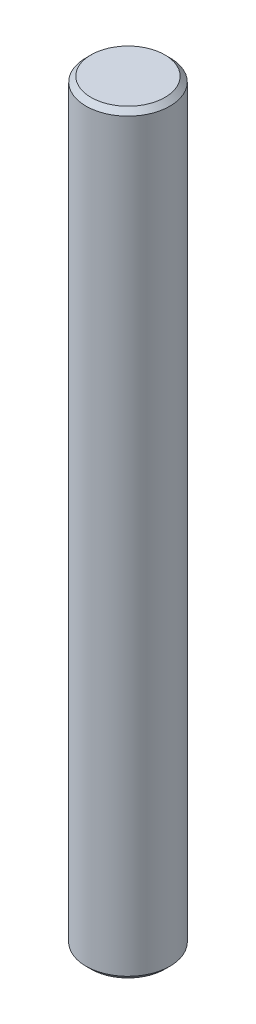
ISO-10303-21;
HEADER;
FILE_DESCRIPTION(('STEP AP214'),'2;1');
FILE_NAME('part.step','',(''),(''),'','','');
FILE_SCHEMA(('AUTOMOTIVE_DESIGN { 1 0 10303 214 1 1 1 1 }'));
ENDSEC;
DATA;
#1=APPLICATION_CONTEXT('core data for automotive mechanical design processes');
#2=APPLICATION_PROTOCOL_DEFINITION('international standard','automotive_design',2000,#1);
#3=PRODUCT_CONTEXT('',#1,'mechanical');
#4=PRODUCT('Part','Part','',(#3));
#5=PRODUCT_RELATED_PRODUCT_CATEGORY('part','',(#4));
#6=PRODUCT_DEFINITION_FORMATION('','',#4);
#7=PRODUCT_DEFINITION_CONTEXT('part definition',#1,'design');
#8=PRODUCT_DEFINITION('design','',#6,#7);
#9=PRODUCT_DEFINITION_SHAPE('','',#8);
#10=(LENGTH_UNIT() NAMED_UNIT(*) SI_UNIT(.MILLI.,.METRE.));
#11=(NAMED_UNIT(*) PLANE_ANGLE_UNIT() SI_UNIT($,.RADIAN.));
#12=(NAMED_UNIT(*) SI_UNIT($,.STERADIAN.) SOLID_ANGLE_UNIT());
#13=UNCERTAINTY_MEASURE_WITH_UNIT(LENGTH_MEASURE(1.E-05),#10,'distance_accuracy_value','');
#14=(GEOMETRIC_REPRESENTATION_CONTEXT(3) GLOBAL_UNCERTAINTY_ASSIGNED_CONTEXT((#13)) GLOBAL_UNIT_ASSIGNED_CONTEXT((#10,
#11,#12)) REPRESENTATION_CONTEXT('',''));
#15=CARTESIAN_POINT('',(0.,0.,0.));
#16=DIRECTION('',(0.,0.,1.));
#17=DIRECTION('',(1.,0.,0.));
#18=AXIS2_PLACEMENT_3D('',#15,#16,#17);
#19=CARTESIAN_POINT('',(0.,45.,0.));
#20=DIRECTION('',(0.,-1.,0.));
#21=DIRECTION('',(0.,0.,-1.));
#22=AXIS2_PLACEMENT_3D('',#19,#20,#21);
#23=CYLINDRICAL_SURFACE('',#22,2.5);
#24=CARTESIAN_POINT('',(0.,0.300000000000043,0.));
#25=DIRECTION('',(0.,1.,0.));
#26=DIRECTION('',(0.,0.,1.));
#27=AXIS2_PLACEMENT_3D('',#24,#25,#26);
#28=CIRCLE('',#27,2.5);
#29=CARTESIAN_POINT('',(0.,0.300000000000043,2.5));
#30=VERTEX_POINT('',#29);
#31=EDGE_CURVE('E43',#30,#30,#28,.T.);
#32=ORIENTED_EDGE('',*,*,#31,.T.);
#33=EDGE_LOOP('',(#32));
#34=FACE_BOUND('',#33,.T.);
#35=CARTESIAN_POINT('',(0.,44.7,0.));
#36=DIRECTION('',(0.,1.,0.));
#37=DIRECTION('',(0.,0.,1.));
#38=AXIS2_PLACEMENT_3D('',#35,#36,#37);
#39=CIRCLE('',#38,2.5);
#40=CARTESIAN_POINT('',(0.,44.7,2.5));
#41=VERTEX_POINT('',#40);
#42=EDGE_CURVE('E47',#41,#41,#39,.F.);
#43=ORIENTED_EDGE('',*,*,#42,.T.);
#44=EDGE_LOOP('',(#43));
#45=FACE_BOUND('',#44,.T.);
#46=ADVANCED_FACE('F32',(#34,#45),#23,.T.);
#47=CARTESIAN_POINT('',(0.,45.,0.));
#48=DIRECTION('',(0.,1.,0.));
#49=DIRECTION('',(0.,0.,1.));
#50=AXIS2_PLACEMENT_3D('',#47,#48,#49);
#51=PLANE('',#50);
#52=CARTESIAN_POINT('',(0.,45.,0.));
#53=DIRECTION('',(0.,1.,0.));
#54=DIRECTION('',(0.,0.,1.));
#55=AXIS2_PLACEMENT_3D('',#52,#53,#54);
#56=CIRCLE('',#55,2.20000000000001);
#57=CARTESIAN_POINT('',(0.,45.,2.20000000000001));
#58=VERTEX_POINT('',#57);
#59=EDGE_CURVE('E10',#58,#58,#56,.T.);
#60=ORIENTED_EDGE('',*,*,#59,.T.);
#61=EDGE_LOOP('',(#60));
#62=FACE_BOUND('',#61,.T.);
#63=ADVANCED_FACE('F63',(#62),#51,.T.);
#64=CARTESIAN_POINT('',(0.,0.,0.));
#65=DIRECTION('',(0.,1.,0.));
#66=DIRECTION('',(0.,0.,1.));
#67=AXIS2_PLACEMENT_3D('',#64,#65,#66);
#68=PLANE('',#67);
#69=CARTESIAN_POINT('',(0.,0.,0.));
#70=DIRECTION('',(0.,1.,0.));
#71=DIRECTION('',(0.,0.,1.));
#72=AXIS2_PLACEMENT_3D('',#69,#70,#71);
#73=CIRCLE('',#72,2.19999999999995);
#74=CARTESIAN_POINT('',(0.,0.,2.19999999999995));
#75=VERTEX_POINT('',#74);
#76=EDGE_CURVE('E39',#75,#75,#73,.F.);
#77=ORIENTED_EDGE('',*,*,#76,.T.);
#78=EDGE_LOOP('',(#77));
#79=FACE_BOUND('',#78,.T.);
#80=ADVANCED_FACE('F60',(#79),#68,.F.);
#81=CARTESIAN_POINT('',(0.,0.300000000000043,0.));
#82=DIRECTION('',(0.,1.,0.));
#83=DIRECTION('',(0.,0.,1.));
#84=AXIS2_PLACEMENT_3D('',#81,#82,#83);
#85=CONICAL_SURFACE('',#84,2.5,0.785398163397452);
#86=ORIENTED_EDGE('',*,*,#76,.F.);
#87=EDGE_LOOP('',(#86));
#88=FACE_BOUND('',#87,.T.);
#89=ORIENTED_EDGE('',*,*,#31,.F.);
#90=EDGE_LOOP('',(#89));
#91=FACE_BOUND('',#90,.T.);
#92=ADVANCED_FACE('F56',(#88,#91),#85,.T.);
#93=CARTESIAN_POINT('',(0.,45.,0.));
#94=DIRECTION('',(0.,-1.,0.));
#95=DIRECTION('',(0.,0.,-1.));
#96=AXIS2_PLACEMENT_3D('',#93,#94,#95);
#97=CONICAL_SURFACE('',#96,2.20000000000001,0.785398163397446);
#98=ORIENTED_EDGE('',*,*,#42,.F.);
#99=EDGE_LOOP('',(#98));
#100=FACE_BOUND('',#99,.T.);
#101=ORIENTED_EDGE('',*,*,#59,.F.);
#102=EDGE_LOOP('',(#101));
#103=FACE_BOUND('',#102,.T.);
#104=ADVANCED_FACE('F34',(#100,#103),#97,.T.);
#105=CLOSED_SHELL('',(#46,#63,#80,#92,#104));
#106=MANIFOLD_SOLID_BREP('B2',#105);
#107=ADVANCED_BREP_SHAPE_REPRESENTATION('',(#18,#106),#14);
#108=SHAPE_DEFINITION_REPRESENTATION(#9,#107);
ENDSEC;
END-ISO-10303-21;
